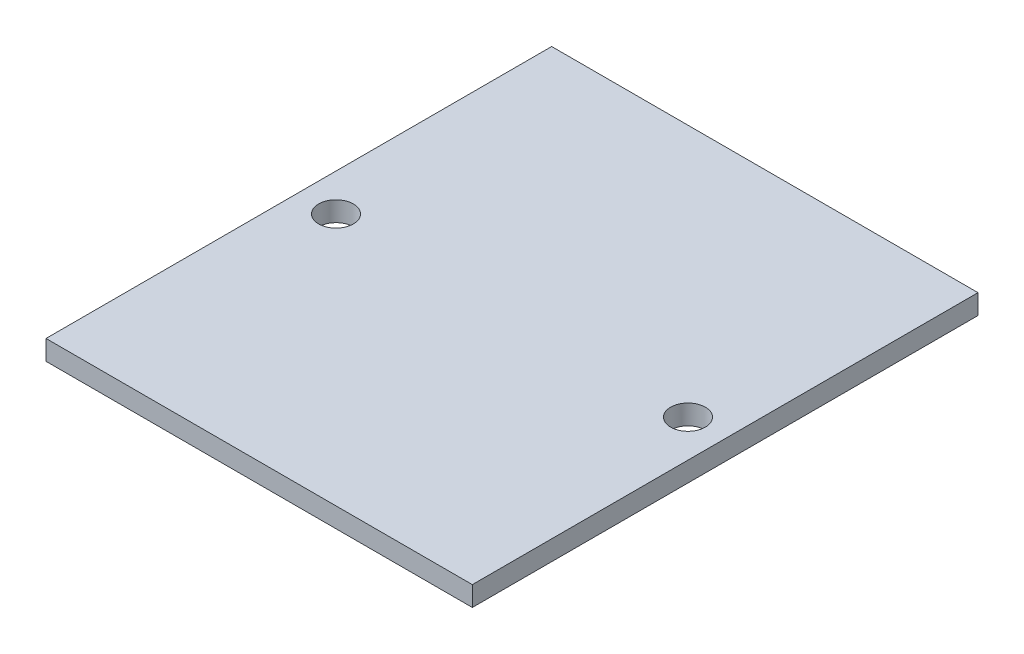
ISO-10303-21;
HEADER;
FILE_DESCRIPTION(('STEP AP214'),'2;1');
FILE_NAME('part.step','',(''),(''),'','','');
FILE_SCHEMA(('AUTOMOTIVE_DESIGN { 1 0 10303 214 1 1 1 1 }'));
ENDSEC;
DATA;
#1=APPLICATION_CONTEXT('core data for automotive mechanical design processes');
#2=APPLICATION_PROTOCOL_DEFINITION('international standard','automotive_design',2000,#1);
#3=PRODUCT_CONTEXT('',#1,'mechanical');
#4=PRODUCT('Part','Part','',(#3));
#5=PRODUCT_RELATED_PRODUCT_CATEGORY('part','',(#4));
#6=PRODUCT_DEFINITION_FORMATION('','',#4);
#7=PRODUCT_DEFINITION_CONTEXT('part definition',#1,'design');
#8=PRODUCT_DEFINITION('design','',#6,#7);
#9=PRODUCT_DEFINITION_SHAPE('','',#8);
#10=(LENGTH_UNIT() NAMED_UNIT(*) SI_UNIT(.MILLI.,.METRE.));
#11=(NAMED_UNIT(*) PLANE_ANGLE_UNIT() SI_UNIT($,.RADIAN.));
#12=(NAMED_UNIT(*) SI_UNIT($,.STERADIAN.) SOLID_ANGLE_UNIT());
#13=UNCERTAINTY_MEASURE_WITH_UNIT(LENGTH_MEASURE(1.E-05),#10,'distance_accuracy_value','');
#14=(GEOMETRIC_REPRESENTATION_CONTEXT(3) GLOBAL_UNCERTAINTY_ASSIGNED_CONTEXT((#13)) GLOBAL_UNIT_ASSIGNED_CONTEXT((#10,
#11,#12)) REPRESENTATION_CONTEXT('',''));
#15=CARTESIAN_POINT('',(0.,0.,0.));
#16=DIRECTION('',(0.,0.,1.));
#17=DIRECTION('',(1.,0.,0.));
#18=AXIS2_PLACEMENT_3D('',#15,#16,#17);
#19=CARTESIAN_POINT('',(-21.5,2.,25.5));
#20=DIRECTION('',(1.,0.,0.));
#21=DIRECTION('',(0.,0.,-1.));
#22=AXIS2_PLACEMENT_3D('',#19,#20,#21);
#23=PLANE('',#22);
#24=DIRECTION('',(0.,0.,1.));
#25=VECTOR('',#24,1.);
#26=CARTESIAN_POINT('',(-21.5,0.,25.5));
#27=LINE('',#26,#25);
#28=CARTESIAN_POINT('',(-21.5,0.,-25.5));
#29=VERTEX_POINT('',#28);
#30=CARTESIAN_POINT('',(-21.5,0.,25.5));
#31=VERTEX_POINT('',#30);
#32=EDGE_CURVE('E107',#29,#31,#27,.T.);
#33=ORIENTED_EDGE('',*,*,#32,.T.);
#34=DIRECTION('',(0.,-1.,0.));
#35=VECTOR('',#34,1.);
#36=CARTESIAN_POINT('',(-21.5,2.,25.5));
#37=LINE('',#36,#35);
#38=CARTESIAN_POINT('',(-21.5,2.,25.5));
#39=VERTEX_POINT('',#38);
#40=EDGE_CURVE('E11',#39,#31,#37,.T.);
#41=ORIENTED_EDGE('',*,*,#40,.F.);
#42=DIRECTION('',(0.,0.,1.));
#43=VECTOR('',#42,1.);
#44=CARTESIAN_POINT('',(-21.5,2.,25.5));
#45=LINE('',#44,#43);
#46=CARTESIAN_POINT('',(-21.5,2.,-25.5));
#47=VERTEX_POINT('',#46);
#48=EDGE_CURVE('E91',#47,#39,#45,.T.);
#49=ORIENTED_EDGE('',*,*,#48,.F.);
#50=DIRECTION('',(0.,-1.,0.));
#51=VECTOR('',#50,1.);
#52=CARTESIAN_POINT('',(-21.5,2.,-25.5));
#53=LINE('',#52,#51);
#54=EDGE_CURVE('E103',#47,#29,#53,.T.);
#55=ORIENTED_EDGE('',*,*,#54,.T.);
#56=EDGE_LOOP('',(#33,#41,#49,#55));
#57=FACE_BOUND('',#56,.T.);
#58=ADVANCED_FACE('F39',(#57),#23,.F.);
#59=CARTESIAN_POINT('',(21.5,2.,25.5));
#60=DIRECTION('',(0.,0.,-1.));
#61=DIRECTION('',(-1.,0.,0.));
#62=AXIS2_PLACEMENT_3D('',#59,#60,#61);
#63=PLANE('',#62);
#64=DIRECTION('',(1.,0.,0.));
#65=VECTOR('',#64,1.);
#66=CARTESIAN_POINT('',(21.5,0.,25.5));
#67=LINE('',#66,#65);
#68=CARTESIAN_POINT('',(21.5,0.,25.5));
#69=VERTEX_POINT('',#68);
#70=EDGE_CURVE('E96',#31,#69,#67,.T.);
#71=ORIENTED_EDGE('',*,*,#70,.T.);
#72=DIRECTION('',(0.,-1.,0.));
#73=VECTOR('',#72,1.);
#74=CARTESIAN_POINT('',(21.5,2.,25.5));
#75=LINE('',#74,#73);
#76=CARTESIAN_POINT('',(21.5,2.,25.5));
#77=VERTEX_POINT('',#76);
#78=EDGE_CURVE('E48',#77,#69,#75,.T.);
#79=ORIENTED_EDGE('',*,*,#78,.F.);
#80=DIRECTION('',(1.,0.,0.));
#81=VECTOR('',#80,1.);
#82=CARTESIAN_POINT('',(21.5,2.,25.5));
#83=LINE('',#82,#81);
#84=EDGE_CURVE('E86',#39,#77,#83,.T.);
#85=ORIENTED_EDGE('',*,*,#84,.F.);
#86=ORIENTED_EDGE('',*,*,#40,.T.);
#87=EDGE_LOOP('',(#71,#79,#85,#86));
#88=FACE_BOUND('',#87,.T.);
#89=ADVANCED_FACE('F95',(#88),#63,.F.);
#90=CARTESIAN_POINT('',(21.5,2.,25.5));
#91=DIRECTION('',(-1.,0.,0.));
#92=DIRECTION('',(0.,0.,1.));
#93=AXIS2_PLACEMENT_3D('',#90,#91,#92);
#94=PLANE('',#93);
#95=DIRECTION('',(0.,0.,-1.));
#96=VECTOR('',#95,1.);
#97=CARTESIAN_POINT('',(21.5,0.,25.5));
#98=LINE('',#97,#96);
#99=CARTESIAN_POINT('',(21.5,0.,-25.5));
#100=VERTEX_POINT('',#99);
#101=EDGE_CURVE('E73',#69,#100,#98,.T.);
#102=ORIENTED_EDGE('',*,*,#101,.T.);
#103=DIRECTION('',(0.,-1.,0.));
#104=VECTOR('',#103,1.);
#105=CARTESIAN_POINT('',(21.5,2.,-25.5));
#106=LINE('',#105,#104);
#107=CARTESIAN_POINT('',(21.5,2.,-25.5));
#108=VERTEX_POINT('',#107);
#109=EDGE_CURVE('E98',#108,#100,#106,.T.);
#110=ORIENTED_EDGE('',*,*,#109,.F.);
#111=DIRECTION('',(0.,0.,-1.));
#112=VECTOR('',#111,1.);
#113=CARTESIAN_POINT('',(21.5,2.,25.5));
#114=LINE('',#113,#112);
#115=EDGE_CURVE('E89',#77,#108,#114,.T.);
#116=ORIENTED_EDGE('',*,*,#115,.F.);
#117=ORIENTED_EDGE('',*,*,#78,.T.);
#118=EDGE_LOOP('',(#102,#110,#116,#117));
#119=FACE_BOUND('',#118,.T.);
#120=ADVANCED_FACE('F99',(#119),#94,.F.);
#121=CARTESIAN_POINT('',(21.5,2.,-25.5));
#122=DIRECTION('',(0.,0.,1.));
#123=DIRECTION('',(1.,0.,0.));
#124=AXIS2_PLACEMENT_3D('',#121,#122,#123);
#125=PLANE('',#124);
#126=DIRECTION('',(-1.,0.,0.));
#127=VECTOR('',#126,1.);
#128=CARTESIAN_POINT('',(21.5,0.,-25.5));
#129=LINE('',#128,#127);
#130=EDGE_CURVE('E79',#100,#29,#129,.T.);
#131=ORIENTED_EDGE('',*,*,#130,.T.);
#132=ORIENTED_EDGE('',*,*,#54,.F.);
#133=DIRECTION('',(-1.,0.,0.));
#134=VECTOR('',#133,1.);
#135=CARTESIAN_POINT('',(21.5,2.,-25.5));
#136=LINE('',#135,#134);
#137=EDGE_CURVE('E56',#108,#47,#136,.T.);
#138=ORIENTED_EDGE('',*,*,#137,.F.);
#139=ORIENTED_EDGE('',*,*,#109,.T.);
#140=EDGE_LOOP('',(#131,#132,#138,#139));
#141=FACE_BOUND('',#140,.T.);
#142=ADVANCED_FACE('F121',(#141),#125,.F.);
#143=CARTESIAN_POINT('',(0.,2.,0.));
#144=DIRECTION('',(0.,1.,0.));
#145=DIRECTION('',(0.,0.,1.));
#146=AXIS2_PLACEMENT_3D('',#143,#144,#145);
#147=PLANE('',#146);
#148=CARTESIAN_POINT('',(-17.75,2.,0.));
#149=DIRECTION('',(0.,1.,0.));
#150=DIRECTION('',(0.,0.,1.));
#151=AXIS2_PLACEMENT_3D('',#148,#149,#150);
#152=CIRCLE('',#151,1.75);
#153=CARTESIAN_POINT('',(-17.75,2.,1.75));
#154=VERTEX_POINT('',#153);
#155=EDGE_CURVE('E132',#154,#154,#152,.T.);
#156=ORIENTED_EDGE('',*,*,#155,.F.);
#157=EDGE_LOOP('',(#156));
#158=FACE_BOUND('',#157,.T.);
#159=CARTESIAN_POINT('',(17.75,2.,-1.06215563775862E-13));
#160=DIRECTION('',(0.,1.,0.));
#161=DIRECTION('',(0.,0.,-1.));
#162=AXIS2_PLACEMENT_3D('',#159,#160,#161);
#163=CIRCLE('',#162,1.75);
#164=CARTESIAN_POINT('',(17.75,2.,-1.75000000000011));
#165=VERTEX_POINT('',#164);
#166=EDGE_CURVE('E133',#165,#165,#163,.T.);
#167=ORIENTED_EDGE('',*,*,#166,.F.);
#168=EDGE_LOOP('',(#167));
#169=FACE_BOUND('',#168,.T.);
#170=ORIENTED_EDGE('',*,*,#48,.T.);
#171=ORIENTED_EDGE('',*,*,#84,.T.);
#172=ORIENTED_EDGE('',*,*,#115,.T.);
#173=ORIENTED_EDGE('',*,*,#137,.T.);
#174=EDGE_LOOP('',(#170,#171,#172,#173));
#175=FACE_BOUND('',#174,.T.);
#176=ADVANCED_FACE('F87',(#158,#169,#175),#147,.T.);
#177=CARTESIAN_POINT('',(0.,0.,0.));
#178=DIRECTION('',(0.,1.,0.));
#179=DIRECTION('',(0.,0.,1.));
#180=AXIS2_PLACEMENT_3D('',#177,#178,#179);
#181=PLANE('',#180);
#182=CARTESIAN_POINT('',(-17.75,0.,0.));
#183=DIRECTION('',(0.,1.,0.));
#184=DIRECTION('',(0.,0.,1.));
#185=AXIS2_PLACEMENT_3D('',#182,#183,#184);
#186=CIRCLE('',#185,1.75);
#187=CARTESIAN_POINT('',(-17.75,0.,1.75));
#188=VERTEX_POINT('',#187);
#189=EDGE_CURVE('E111',#188,#188,#186,.F.);
#190=ORIENTED_EDGE('',*,*,#189,.F.);
#191=EDGE_LOOP('',(#190));
#192=FACE_BOUND('',#191,.T.);
#193=CARTESIAN_POINT('',(17.75,0.,-1.06215563775862E-13));
#194=DIRECTION('',(0.,1.,0.));
#195=DIRECTION('',(0.,0.,1.));
#196=AXIS2_PLACEMENT_3D('',#193,#194,#195);
#197=CIRCLE('',#196,1.75);
#198=CARTESIAN_POINT('',(17.75,0.,1.7499999999999));
#199=VERTEX_POINT('',#198);
#200=EDGE_CURVE('E128',#199,#199,#197,.F.);
#201=ORIENTED_EDGE('',*,*,#200,.F.);
#202=EDGE_LOOP('',(#201));
#203=FACE_BOUND('',#202,.T.);
#204=ORIENTED_EDGE('',*,*,#32,.F.);
#205=ORIENTED_EDGE('',*,*,#130,.F.);
#206=ORIENTED_EDGE('',*,*,#101,.F.);
#207=ORIENTED_EDGE('',*,*,#70,.F.);
#208=EDGE_LOOP('',(#204,#205,#206,#207));
#209=FACE_BOUND('',#208,.T.);
#210=ADVANCED_FACE('F124',(#192,#203,#209),#181,.F.);
#211=CARTESIAN_POINT('',(17.75,-4.94974746830584,-1.06215563775862E-13));
#212=DIRECTION('',(0.,1.,0.));
#213=DIRECTION('',(0.,0.,1.));
#214=AXIS2_PLACEMENT_3D('',#211,#212,#213);
#215=CYLINDRICAL_SURFACE('',#214,1.75);
#216=ORIENTED_EDGE('',*,*,#200,.T.);
#217=EDGE_LOOP('',(#216));
#218=FACE_BOUND('',#217,.T.);
#219=ORIENTED_EDGE('',*,*,#166,.T.);
#220=EDGE_LOOP('',(#219));
#221=FACE_BOUND('',#220,.T.);
#222=ADVANCED_FACE('F151',(#218,#221),#215,.F.);
#223=CARTESIAN_POINT('',(-17.75,-4.94974746830584,0.));
#224=DIRECTION('',(0.,1.,0.));
#225=DIRECTION('',(0.,0.,1.));
#226=AXIS2_PLACEMENT_3D('',#223,#224,#225);
#227=CYLINDRICAL_SURFACE('',#226,1.75);
#228=ORIENTED_EDGE('',*,*,#189,.T.);
#229=EDGE_LOOP('',(#228));
#230=FACE_BOUND('',#229,.T.);
#231=ORIENTED_EDGE('',*,*,#155,.T.);
#232=EDGE_LOOP('',(#231));
#233=FACE_BOUND('',#232,.T.);
#234=ADVANCED_FACE('F144',(#230,#233),#227,.F.);
#235=CLOSED_SHELL('',(#58,#89,#120,#142,#176,#210,#222,#234));
#236=MANIFOLD_SOLID_BREP('B2',#235);
#237=ADVANCED_BREP_SHAPE_REPRESENTATION('',(#18,#236),#14);
#238=SHAPE_DEFINITION_REPRESENTATION(#9,#237);
ENDSEC;
END-ISO-10303-21;
